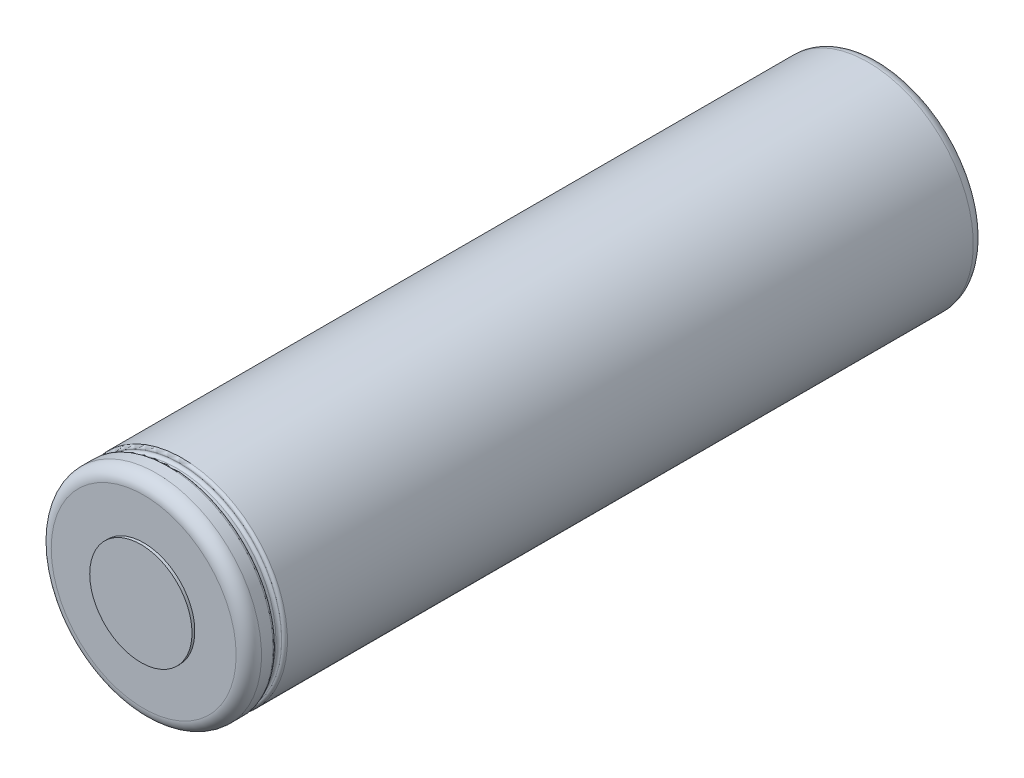
ISO-10303-21;
HEADER;
FILE_DESCRIPTION(('STEP AP214'),'2;1');
FILE_NAME('part.step','',(''),(''),'','','');
FILE_SCHEMA(('AUTOMOTIVE_DESIGN { 1 0 10303 214 1 1 1 1 }'));
ENDSEC;
DATA;
#1=APPLICATION_CONTEXT('core data for automotive mechanical design processes');
#2=APPLICATION_PROTOCOL_DEFINITION('international standard','automotive_design',2000,#1);
#3=PRODUCT_CONTEXT('',#1,'mechanical');
#4=PRODUCT('Part','Part','',(#3));
#5=PRODUCT_RELATED_PRODUCT_CATEGORY('part','',(#4));
#6=PRODUCT_DEFINITION_FORMATION('','',#4);
#7=PRODUCT_DEFINITION_CONTEXT('part definition',#1,'design');
#8=PRODUCT_DEFINITION('design','',#6,#7);
#9=PRODUCT_DEFINITION_SHAPE('','',#8);
#10=(LENGTH_UNIT() NAMED_UNIT(*) SI_UNIT(.MILLI.,.METRE.));
#11=(NAMED_UNIT(*) PLANE_ANGLE_UNIT() SI_UNIT($,.RADIAN.));
#12=(NAMED_UNIT(*) SI_UNIT($,.STERADIAN.) SOLID_ANGLE_UNIT());
#13=UNCERTAINTY_MEASURE_WITH_UNIT(LENGTH_MEASURE(1.E-05),#10,'distance_accuracy_value','');
#14=(GEOMETRIC_REPRESENTATION_CONTEXT(3) GLOBAL_UNCERTAINTY_ASSIGNED_CONTEXT((#13)) GLOBAL_UNIT_ASSIGNED_CONTEXT((#10,
#11,#12)) REPRESENTATION_CONTEXT('',''));
#15=CARTESIAN_POINT('',(0.,0.,0.));
#16=DIRECTION('',(0.,0.,1.));
#17=DIRECTION('',(1.,0.,0.));
#18=AXIS2_PLACEMENT_3D('',#15,#16,#17);
#19=CARTESIAN_POINT('',(0.,8.24999999999999,0.));
#20=DIRECTION('',(0.,0.,-1.));
#21=DIRECTION('',(-1.,0.,0.));
#22=AXIS2_PLACEMENT_3D('',#19,#20,#21);
#23=PLANE('',#22);
#24=CARTESIAN_POINT('',(0.,0.,0.));
#25=DIRECTION('',(0.,0.,-1.));
#26=DIRECTION('',(-1.,0.,0.));
#27=AXIS2_PLACEMENT_3D('',#24,#25,#26);
#28=CIRCLE('',#27,8.24999999999999);
#29=CARTESIAN_POINT('',(-8.24999999999999,0.,0.));
#30=VERTEX_POINT('',#29);
#31=EDGE_CURVE('E78',#30,#30,#28,.T.);
#32=ORIENTED_EDGE('',*,*,#31,.T.);
#33=EDGE_LOOP('',(#32));
#34=FACE_BOUND('',#33,.T.);
#35=ADVANCED_FACE('F32',(#34),#23,.T.);
#36=CARTESIAN_POINT('',(0.,4.49999999999999,65.));
#37=DIRECTION('',(0.,0.,1.));
#38=DIRECTION('',(1.,0.,0.));
#39=AXIS2_PLACEMENT_3D('',#36,#37,#38);
#40=PLANE('',#39);
#41=CARTESIAN_POINT('',(0.,0.,65.));
#42=DIRECTION('',(0.,0.,-1.));
#43=DIRECTION('',(-1.,0.,0.));
#44=AXIS2_PLACEMENT_3D('',#41,#42,#43);
#45=CIRCLE('',#44,4.49999999999999);
#46=CARTESIAN_POINT('',(-4.49999999999999,0.,65.));
#47=VERTEX_POINT('',#46);
#48=EDGE_CURVE('E10',#47,#47,#45,.T.);
#49=ORIENTED_EDGE('',*,*,#48,.F.);
#50=EDGE_LOOP('',(#49));
#51=FACE_BOUND('',#50,.T.);
#52=ADVANCED_FACE('F95',(#51),#40,.T.);
#53=CARTESIAN_POINT('',(0.,0.,0.));
#54=DIRECTION('',(0.,0.,-1.));
#55=DIRECTION('',(-1.,0.,0.));
#56=AXIS2_PLACEMENT_3D('',#53,#54,#55);
#57=CYLINDRICAL_SURFACE('',#56,4.49999999999999);
#58=ORIENTED_EDGE('',*,*,#48,.T.);
#59=EDGE_LOOP('',(#58));
#60=FACE_BOUND('',#59,.T.);
#61=CARTESIAN_POINT('',(0.,0.,64.75));
#62=DIRECTION('',(0.,0.,-1.));
#63=DIRECTION('',(-1.,0.,0.));
#64=AXIS2_PLACEMENT_3D('',#61,#62,#63);
#65=CIRCLE('',#64,4.49999999999999);
#66=CARTESIAN_POINT('',(-4.49999999999999,0.,64.75));
#67=VERTEX_POINT('',#66);
#68=EDGE_CURVE('E38',#67,#67,#65,.T.);
#69=ORIENTED_EDGE('',*,*,#68,.F.);
#70=EDGE_LOOP('',(#69));
#71=FACE_BOUND('',#70,.T.);
#72=ADVANCED_FACE('F99',(#60,#71),#57,.T.);
#73=CARTESIAN_POINT('',(0.,8.13610369484508,64.75));
#74=DIRECTION('',(0.,0.,1.));
#75=DIRECTION('',(1.,0.,0.));
#76=AXIS2_PLACEMENT_3D('',#73,#74,#75);
#77=PLANE('',#76);
#78=ORIENTED_EDGE('',*,*,#68,.T.);
#79=EDGE_LOOP('',(#78));
#80=FACE_BOUND('',#79,.T.);
#81=CARTESIAN_POINT('',(0.,0.,64.75));
#82=DIRECTION('',(0.,0.,-1.));
#83=DIRECTION('',(-1.,0.,0.));
#84=AXIS2_PLACEMENT_3D('',#81,#82,#83);
#85=CIRCLE('',#84,8.13610369484508);
#86=CARTESIAN_POINT('',(-8.13610369484508,0.,64.75));
#87=VERTEX_POINT('',#86);
#88=EDGE_CURVE('E42',#87,#87,#85,.T.);
#89=ORIENTED_EDGE('',*,*,#88,.F.);
#90=EDGE_LOOP('',(#89));
#91=FACE_BOUND('',#90,.T.);
#92=ADVANCED_FACE('F104',(#80,#91),#77,.T.);
#93=CARTESIAN_POINT('',(0.,0.,63.6361036948451));
#94=DIRECTION('',(0.,0.,-1.));
#95=DIRECTION('',(-1.,0.,0.));
#96=AXIS2_PLACEMENT_3D('',#93,#94,#95);
#97=TOROIDAL_SURFACE('',#96,8.13610369484508,1.11389630515492);
#98=ORIENTED_EDGE('',*,*,#88,.T.);
#99=EDGE_LOOP('',(#98));
#100=FACE_BOUND('',#99,.T.);
#101=CARTESIAN_POINT('',(0.,0.,63.6361036948451));
#102=DIRECTION('',(0.,0.,-1.));
#103=DIRECTION('',(-1.,0.,0.));
#104=AXIS2_PLACEMENT_3D('',#101,#102,#103);
#105=CIRCLE('',#104,9.24999999999999);
#106=CARTESIAN_POINT('',(-9.24999999999999,0.,63.6361036948451));
#107=VERTEX_POINT('',#106);
#108=EDGE_CURVE('E46',#107,#107,#105,.T.);
#109=ORIENTED_EDGE('',*,*,#108,.F.);
#110=EDGE_LOOP('',(#109));
#111=FACE_BOUND('',#110,.T.);
#112=ADVANCED_FACE('F109',(#100,#111),#97,.T.);
#113=CARTESIAN_POINT('',(0.,0.,0.));
#114=DIRECTION('',(0.,0.,-1.));
#115=DIRECTION('',(-1.,0.,0.));
#116=AXIS2_PLACEMENT_3D('',#113,#114,#115);
#117=CYLINDRICAL_SURFACE('',#116,9.24999999999999);
#118=ORIENTED_EDGE('',*,*,#108,.T.);
#119=EDGE_LOOP('',(#118));
#120=FACE_BOUND('',#119,.T.);
#121=CARTESIAN_POINT('',(0.,0.,62.6056542551936));
#122=DIRECTION('',(0.,0.,-1.));
#123=DIRECTION('',(-1.,0.,0.));
#124=AXIS2_PLACEMENT_3D('',#121,#122,#123);
#125=CIRCLE('',#124,9.24999999999999);
#126=CARTESIAN_POINT('',(-9.24999999999999,0.,62.6056542551936));
#127=VERTEX_POINT('',#126);
#128=EDGE_CURVE('E51',#127,#127,#125,.T.);
#129=ORIENTED_EDGE('',*,*,#128,.F.);
#130=EDGE_LOOP('',(#129));
#131=FACE_BOUND('',#130,.T.);
#132=ADVANCED_FACE('F112',(#120,#131),#117,.T.);
#133=CARTESIAN_POINT('',(0.,0.,62.6056542551936));
#134=DIRECTION('',(0.,0.,-1.));
#135=DIRECTION('',(-1.,0.,0.));
#136=AXIS2_PLACEMENT_3D('',#133,#134,#135);
#137=TOROIDAL_SURFACE('',#136,8.99999999999999,0.249999999999999);
#138=ORIENTED_EDGE('',*,*,#128,.T.);
#139=EDGE_LOOP('',(#138));
#140=FACE_BOUND('',#139,.T.);
#141=CARTESIAN_POINT('',(0.,0.,62.3556542551936));
#142=DIRECTION('',(0.,0.,-1.));
#143=DIRECTION('',(-1.,0.,0.));
#144=AXIS2_PLACEMENT_3D('',#141,#142,#143);
#145=CIRCLE('',#144,8.99999999999999);
#146=CARTESIAN_POINT('',(-8.99999999999999,0.,62.3556542551936));
#147=VERTEX_POINT('',#146);
#148=EDGE_CURVE('E54',#147,#147,#145,.T.);
#149=ORIENTED_EDGE('',*,*,#148,.F.);
#150=EDGE_LOOP('',(#149));
#151=FACE_BOUND('',#150,.T.);
#152=ADVANCED_FACE('F116',(#140,#151),#137,.T.);
#153=CARTESIAN_POINT('',(0.,8.99999999999999,62.3556542551936));
#154=DIRECTION('',(0.,0.,-1.));
#155=DIRECTION('',(-1.,0.,0.));
#156=AXIS2_PLACEMENT_3D('',#153,#154,#155);
#157=PLANE('',#156);
#158=ORIENTED_EDGE('',*,*,#148,.T.);
#159=EDGE_LOOP('',(#158));
#160=FACE_BOUND('',#159,.T.);
#161=CARTESIAN_POINT('',(0.,0.,62.3556542551936));
#162=DIRECTION('',(0.,0.,-1.));
#163=DIRECTION('',(-1.,0.,0.));
#164=AXIS2_PLACEMENT_3D('',#161,#162,#163);
#165=CIRCLE('',#164,8.98970810454827);
#166=CARTESIAN_POINT('',(-8.98970810454827,0.,62.3556542551936));
#167=VERTEX_POINT('',#166);
#168=EDGE_CURVE('E57',#167,#167,#165,.T.);
#169=ORIENTED_EDGE('',*,*,#168,.F.);
#170=EDGE_LOOP('',(#169));
#171=FACE_BOUND('',#170,.T.);
#172=ADVANCED_FACE('F120',(#160,#171),#157,.T.);
#173=CARTESIAN_POINT('',(0.,0.,62.1056542551936));
#174=DIRECTION('',(0.,0.,-1.));
#175=DIRECTION('',(-1.,0.,0.));
#176=AXIS2_PLACEMENT_3D('',#173,#174,#175);
#177=TOROIDAL_SURFACE('',#176,8.98970810454827,0.249999999999999);
#178=ORIENTED_EDGE('',*,*,#168,.T.);
#179=EDGE_LOOP('',(#178));
#180=FACE_BOUND('',#179,.T.);
#181=CARTESIAN_POINT('',(0.,0.,62.1056542551936));
#182=DIRECTION('',(0.,0.,-1.));
#183=DIRECTION('',(-1.,0.,0.));
#184=AXIS2_PLACEMENT_3D('',#181,#182,#183);
#185=CIRCLE('',#184,8.73970810454827);
#186=CARTESIAN_POINT('',(-8.73970810454827,0.,62.1056542551936));
#187=VERTEX_POINT('',#186);
#188=EDGE_CURVE('E60',#187,#187,#185,.T.);
#189=ORIENTED_EDGE('',*,*,#188,.F.);
#190=EDGE_LOOP('',(#189));
#191=FACE_BOUND('',#190,.T.);
#192=ADVANCED_FACE('F124',(#180,#191),#177,.F.);
#193=CARTESIAN_POINT('',(0.,0.,0.));
#194=DIRECTION('',(0.,0.,-1.));
#195=DIRECTION('',(-1.,0.,0.));
#196=AXIS2_PLACEMENT_3D('',#193,#194,#195);
#197=CYLINDRICAL_SURFACE('',#196,8.73970810454827);
#198=ORIENTED_EDGE('',*,*,#188,.T.);
#199=EDGE_LOOP('',(#198));
#200=FACE_BOUND('',#199,.T.);
#201=CARTESIAN_POINT('',(0.,0.,61.8538395467638));
#202=DIRECTION('',(0.,0.,-1.));
#203=DIRECTION('',(-1.,0.,0.));
#204=AXIS2_PLACEMENT_3D('',#201,#202,#203);
#205=CIRCLE('',#204,8.73970810454827);
#206=CARTESIAN_POINT('',(-8.73970810454827,0.,61.8538395467638));
#207=VERTEX_POINT('',#206);
#208=EDGE_CURVE('E63',#207,#207,#205,.T.);
#209=ORIENTED_EDGE('',*,*,#208,.F.);
#210=EDGE_LOOP('',(#209));
#211=FACE_BOUND('',#210,.T.);
#212=ADVANCED_FACE('F128',(#200,#211),#197,.T.);
#213=CARTESIAN_POINT('',(0.,0.,61.8538395467638));
#214=DIRECTION('',(0.,0.,-1.));
#215=DIRECTION('',(-1.,0.,0.));
#216=AXIS2_PLACEMENT_3D('',#213,#214,#215);
#217=TOROIDAL_SURFACE('',#216,8.98970810454827,0.249999999999999);
#218=ORIENTED_EDGE('',*,*,#208,.T.);
#219=EDGE_LOOP('',(#218));
#220=FACE_BOUND('',#219,.T.);
#221=CARTESIAN_POINT('',(0.,0.,61.6038395467638));
#222=DIRECTION('',(0.,0.,-1.));
#223=DIRECTION('',(-1.,0.,0.));
#224=AXIS2_PLACEMENT_3D('',#221,#222,#223);
#225=CIRCLE('',#224,8.98970810454827);
#226=CARTESIAN_POINT('',(-8.98970810454827,0.,61.6038395467638));
#227=VERTEX_POINT('',#226);
#228=EDGE_CURVE('E66',#227,#227,#225,.T.);
#229=ORIENTED_EDGE('',*,*,#228,.F.);
#230=EDGE_LOOP('',(#229));
#231=FACE_BOUND('',#230,.T.);
#232=ADVANCED_FACE('F132',(#220,#231),#217,.F.);
#233=CARTESIAN_POINT('',(0.,8.98970810454827,61.6038395467638));
#234=DIRECTION('',(0.,0.,1.));
#235=DIRECTION('',(1.,0.,0.));
#236=AXIS2_PLACEMENT_3D('',#233,#234,#235);
#237=PLANE('',#236);
#238=ORIENTED_EDGE('',*,*,#228,.T.);
#239=EDGE_LOOP('',(#238));
#240=FACE_BOUND('',#239,.T.);
#241=CARTESIAN_POINT('',(0.,0.,61.6038395467638));
#242=DIRECTION('',(0.,0.,-1.));
#243=DIRECTION('',(-1.,0.,0.));
#244=AXIS2_PLACEMENT_3D('',#241,#242,#243);
#245=CIRCLE('',#244,8.99999999999999);
#246=CARTESIAN_POINT('',(-8.99999999999999,0.,61.6038395467638));
#247=VERTEX_POINT('',#246);
#248=EDGE_CURVE('E69',#247,#247,#245,.T.);
#249=ORIENTED_EDGE('',*,*,#248,.F.);
#250=EDGE_LOOP('',(#249));
#251=FACE_BOUND('',#250,.T.);
#252=ADVANCED_FACE('F136',(#240,#251),#237,.T.);
#253=CARTESIAN_POINT('',(0.,0.,61.3538395467638));
#254=DIRECTION('',(0.,0.,-1.));
#255=DIRECTION('',(-1.,0.,0.));
#256=AXIS2_PLACEMENT_3D('',#253,#254,#255);
#257=TOROIDAL_SURFACE('',#256,8.99999999999999,0.25);
#258=ORIENTED_EDGE('',*,*,#248,.T.);
#259=EDGE_LOOP('',(#258));
#260=FACE_BOUND('',#259,.T.);
#261=CARTESIAN_POINT('',(0.,0.,61.3538395467638));
#262=DIRECTION('',(0.,0.,-1.));
#263=DIRECTION('',(-1.,0.,0.));
#264=AXIS2_PLACEMENT_3D('',#261,#262,#263);
#265=CIRCLE('',#264,9.24999999999999);
#266=CARTESIAN_POINT('',(-9.24999999999999,0.,61.3538395467638));
#267=VERTEX_POINT('',#266);
#268=EDGE_CURVE('E72',#267,#267,#265,.T.);
#269=ORIENTED_EDGE('',*,*,#268,.F.);
#270=EDGE_LOOP('',(#269));
#271=FACE_BOUND('',#270,.T.);
#272=ADVANCED_FACE('F91',(#260,#271),#257,.T.);
#273=CARTESIAN_POINT('',(0.,0.,0.));
#274=DIRECTION('',(0.,0.,-1.));
#275=DIRECTION('',(-1.,0.,0.));
#276=AXIS2_PLACEMENT_3D('',#273,#274,#275);
#277=CYLINDRICAL_SURFACE('',#276,9.24999999999999);
#278=ORIENTED_EDGE('',*,*,#268,.T.);
#279=EDGE_LOOP('',(#278));
#280=FACE_BOUND('',#279,.T.);
#281=CARTESIAN_POINT('',(0.,0.,1.));
#282=DIRECTION('',(0.,0.,-1.));
#283=DIRECTION('',(-1.,0.,0.));
#284=AXIS2_PLACEMENT_3D('',#281,#282,#283);
#285=CIRCLE('',#284,9.24999999999999);
#286=CARTESIAN_POINT('',(-9.24999999999999,0.,1.));
#287=VERTEX_POINT('',#286);
#288=EDGE_CURVE('E75',#287,#287,#285,.T.);
#289=ORIENTED_EDGE('',*,*,#288,.F.);
#290=EDGE_LOOP('',(#289));
#291=FACE_BOUND('',#290,.T.);
#292=ADVANCED_FACE('F85',(#280,#291),#277,.T.);
#293=CARTESIAN_POINT('',(0.,0.,1.));
#294=DIRECTION('',(0.,0.,-1.));
#295=DIRECTION('',(-1.,0.,0.));
#296=AXIS2_PLACEMENT_3D('',#293,#294,#295);
#297=TOROIDAL_SURFACE('',#296,8.24999999999999,1.);
#298=ORIENTED_EDGE('',*,*,#288,.T.);
#299=EDGE_LOOP('',(#298));
#300=FACE_BOUND('',#299,.T.);
#301=ORIENTED_EDGE('',*,*,#31,.F.);
#302=EDGE_LOOP('',(#301));
#303=FACE_BOUND('',#302,.T.);
#304=ADVANCED_FACE('F83',(#300,#303),#297,.T.);
#305=CLOSED_SHELL('',(#35,#52,#72,#92,#112,#132,#152,#172,#192,#212,#232,#252,#272,#292,#304));
#306=MANIFOLD_SOLID_BREP('B2',#305);
#307=ADVANCED_BREP_SHAPE_REPRESENTATION('',(#18,#306),#14);
#308=SHAPE_DEFINITION_REPRESENTATION(#9,#307);
ENDSEC;
END-ISO-10303-21;
